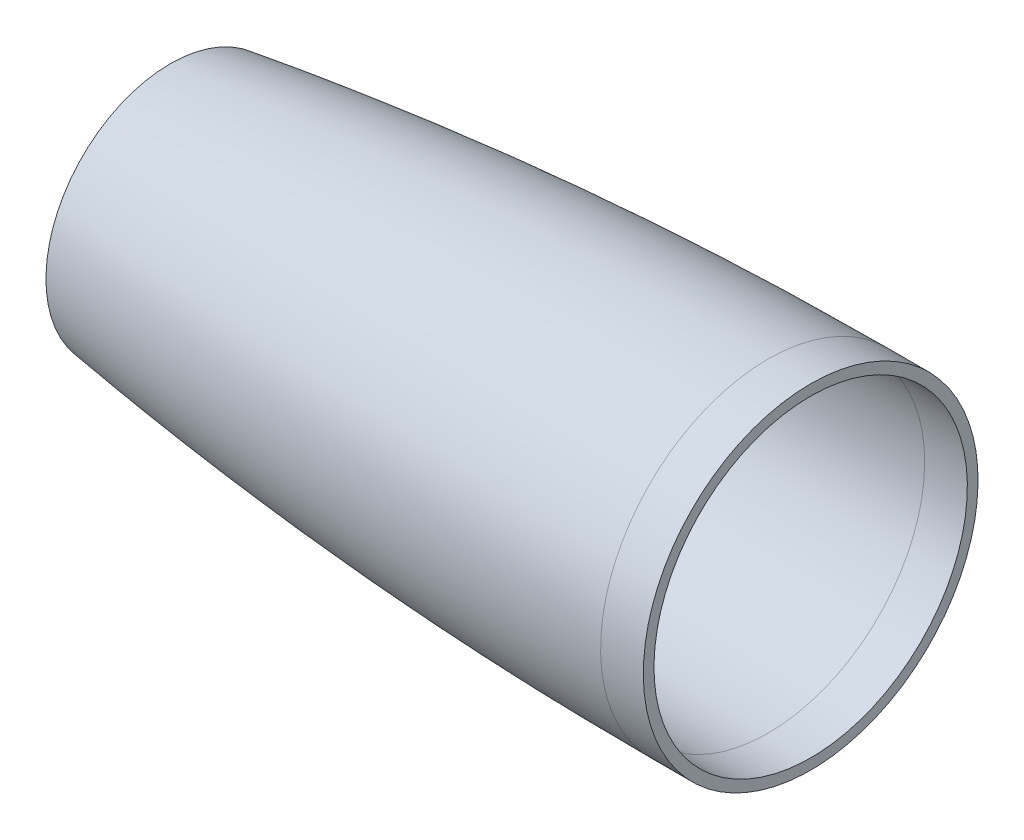
ISO-10303-21;
HEADER;
FILE_DESCRIPTION(('STEP AP214'),'2;1');
FILE_NAME('part.step','',(''),(''),'','','');
FILE_SCHEMA(('AUTOMOTIVE_DESIGN { 1 0 10303 214 1 1 1 1 }'));
ENDSEC;
DATA;
#1=APPLICATION_CONTEXT('core data for automotive mechanical design processes');
#2=APPLICATION_PROTOCOL_DEFINITION('international standard','automotive_design',2000,#1);
#3=PRODUCT_CONTEXT('',#1,'mechanical');
#4=PRODUCT('Part','Part','',(#3));
#5=PRODUCT_RELATED_PRODUCT_CATEGORY('part','',(#4));
#6=PRODUCT_DEFINITION_FORMATION('','',#4);
#7=PRODUCT_DEFINITION_CONTEXT('part definition',#1,'design');
#8=PRODUCT_DEFINITION('design','',#6,#7);
#9=PRODUCT_DEFINITION_SHAPE('','',#8);
#10=(LENGTH_UNIT() NAMED_UNIT(*) SI_UNIT(.MILLI.,.METRE.));
#11=(NAMED_UNIT(*) PLANE_ANGLE_UNIT() SI_UNIT($,.RADIAN.));
#12=(NAMED_UNIT(*) SI_UNIT($,.STERADIAN.) SOLID_ANGLE_UNIT());
#13=UNCERTAINTY_MEASURE_WITH_UNIT(LENGTH_MEASURE(1.E-05),#10,'distance_accuracy_value','');
#14=(GEOMETRIC_REPRESENTATION_CONTEXT(3) GLOBAL_UNCERTAINTY_ASSIGNED_CONTEXT((#13)) GLOBAL_UNIT_ASSIGNED_CONTEXT((#10,
#11,#12)) REPRESENTATION_CONTEXT('',''));
#15=CARTESIAN_POINT('',(0.,0.,0.));
#16=DIRECTION('',(0.,0.,1.));
#17=DIRECTION('',(1.,0.,0.));
#18=AXIS2_PLACEMENT_3D('',#15,#16,#17);
#19=CARTESIAN_POINT('',(507.999999999505,0.,0.));
#20=DIRECTION('',(-1.,0.,0.));
#21=DIRECTION('',(0.,-1.,0.));
#22=AXIS2_PLACEMENT_3D('',#19,#20,#21);
#23=CYLINDRICAL_SURFACE('',#22,49.784);
#24=CARTESIAN_POINT('',(304.799999999505,0.,0.));
#25=DIRECTION('',(1.,0.,0.));
#26=DIRECTION('',(0.,1.,0.));
#27=AXIS2_PLACEMENT_3D('',#24,#25,#26);
#28=CIRCLE('',#27,49.784);
#29=CARTESIAN_POINT('',(304.799999999505,49.784,0.));
#30=VERTEX_POINT('',#29);
#31=EDGE_CURVE('E10',#30,#30,#28,.T.);
#32=ORIENTED_EDGE('',*,*,#31,.T.);
#33=EDGE_LOOP('',(#32));
#34=FACE_BOUND('',#33,.T.);
#35=CARTESIAN_POINT('',(317.499999999505,0.,0.));
#36=DIRECTION('',(1.,0.,0.));
#37=DIRECTION('',(0.,1.,0.));
#38=AXIS2_PLACEMENT_3D('',#35,#36,#37);
#39=CIRCLE('',#38,49.784);
#40=CARTESIAN_POINT('',(317.499999999505,49.784,0.));
#41=VERTEX_POINT('',#40);
#42=EDGE_CURVE('E48',#41,#41,#39,.T.);
#43=ORIENTED_EDGE('',*,*,#42,.F.);
#44=EDGE_LOOP('',(#43));
#45=FACE_BOUND('',#44,.T.);
#46=ADVANCED_FACE('F40',(#34,#45),#23,.T.);
#47=CARTESIAN_POINT('',(304.799999990287,49.7839999999356,0.));
#48=CARTESIAN_POINT('',(304.362420109321,49.7839999999268,0.));
#49=CARTESIAN_POINT('',(303.482211221152,49.7834088052548,0.));
#50=CARTESIAN_POINT('',(301.617177870666,49.7807484292649,0.));
#51=CARTESIAN_POINT('',(299.535126271052,49.7736541034944,0.));
#52=CARTESIAN_POINT('',(297.470177020612,49.7630126402219,0.));
#53=CARTESIAN_POINT('',(295.35918685804,49.7488240698795,0.));
#54=CARTESIAN_POINT('',(293.263778354198,49.7310884330478,0.));
#55=CARTESIAN_POINT('',(291.166731436806,49.7098057804495,0.));
#56=CARTESIAN_POINT('',(288.521672795546,49.6784952503172,0.));
#57=CARTESIAN_POINT('',(285.329649652529,49.6334265452577,0.));
#58=CARTESIAN_POINT('',(281.590188304048,49.5699030834589,0.));
#59=CARTESIAN_POINT('',(277.303691578309,49.48226239004,0.));
#60=CARTESIAN_POINT('',(273.017475856952,49.3798045532393,0.));
#61=CARTESIAN_POINT('',(268.731666264679,49.262530797284,0.));
#62=CARTESIAN_POINT('',(264.446272338637,49.1304425234462,0.));
#63=CARTESIAN_POINT('',(260.161369668181,48.9835413100188,0.));
#64=CARTESIAN_POINT('',(253.734807706703,48.7409727135402,0.));
#65=CARTESIAN_POINT('',(245.168015053762,48.3681837485972,0.));
#66=CARTESIAN_POINT('',(207.702302927604,46.4349626079382,0.));
#67=CARTESIAN_POINT('',(160.707329089507,42.1599209125125,0.));
#68=CARTESIAN_POINT('',(110.770450736802,35.2251211949369,0.));
#69=CARTESIAN_POINT('',(62.3339038753587,25.9763701994142,0.));
#70=CARTESIAN_POINT('',(42.4128979252964,21.742539101878,0.));
#71=CARTESIAN_POINT('',(31.9521680351812,19.4056754890413,0.));
#72=CARTESIAN_POINT('',(26.7272384393463,18.2131472626268,0.));
#73=CARTESIAN_POINT('',(22.5506525227574,17.2446900479098,0.));
#74=CARTESIAN_POINT('',(18.9102609099226,16.3872914736853,0.));
#75=CARTESIAN_POINT('',(15.8050492233456,15.6465359898865,0.));
#76=CARTESIAN_POINT('',(13.2334128844101,15.0268619640981,0.));
#77=CARTESIAN_POINT('',(11.1954442275076,14.5321411193525,0.));
#78=CARTESIAN_POINT('',(9.15994822447513,14.0343879217128,0.));
#79=CARTESIAN_POINT('',(7.11012855188908,13.5293440242189,0.));
#80=CARTESIAN_POINT('',(5.10622259628834,13.032281092588,0.));
#81=CARTESIAN_POINT('',(3.08541050477275,12.5272726670259,0.));
#82=CARTESIAN_POINT('',(1.27776800563499,12.0717339202754,0.));
#83=CARTESIAN_POINT('',(0.424160674864923,11.8559326777936,0.));
#84=CARTESIAN_POINT('',(-8.94262127456441E-09,11.7483971703143,0.));
#85=B_SPLINE_CURVE_WITH_KNOTS('',4,(#47,#48,#49,#50,#51,#52,#53,#54,#55,#56,#57,#58,#59,#60,#61,
#62,#63,#64,#65,#66,#67,#68,#69,#70,#71,#72,#73,#74,#75,#76,#77,#78,#79,#80,#81,#82,#83,#84),
.UNSPECIFIED.,.F.,.F.,(5,1,1,1,1,1,1,1,1,1,1,1,1,1,1,1,1,1,1,1,1,1,1,1,1,1,1,1,1,1,1,1,1,1,5),
(0.0829178151015879,0.0886015106363571,0.0942852061412064,0.0999689016460558,0.105652597150905,
0.111336292655755,0.117019988160604,0.122703683665453,0.128387379170303,0.140005214528904,
0.151623049887505,0.163240885246106,0.174858720604706,0.18647655605003,0.198094391495354,
0.209712226940678,0.221330062386002,0.256183568844847,0.291037074687809,0.616336464163029,
0.732514817876367,0.802221831447538,0.825457500655397,0.837075336998531,0.848693173341665,
0.8603110096848,0.871928846027934,0.877612541812259,0.883296237596584,0.888979933380909,
0.894663629165234,0.900347324949559,0.906031020733883,0.911714716518208,0.917398412270913),.UNSPECIFIED.);
#86=CARTESIAN_POINT('',(304.799999999505,0.,0.));
#87=DIRECTION('',(1.,0.,0.));
#88=AXIS1_PLACEMENT('',#86,#87);
#89=SURFACE_OF_REVOLUTION('',#85,#88);
#90=CARTESIAN_POINT('',(126.999999999505,0.,0.));
#91=DIRECTION('',(1.,0.,0.));
#92=DIRECTION('',(0.,1.,0.));
#93=AXIS2_PLACEMENT_3D('',#90,#91,#92);
#94=CIRCLE('',#93,36.9736278029773);
#95=CARTESIAN_POINT('',(126.999999999505,36.9736278029773,0.));
#96=VERTEX_POINT('',#95);
#97=EDGE_CURVE('E43',#96,#96,#94,.F.);
#98=ORIENTED_EDGE('',*,*,#97,.F.);
#99=EDGE_LOOP('',(#98));
#100=FACE_BOUND('',#99,.T.);
#101=ORIENTED_EDGE('',*,*,#31,.F.);
#102=EDGE_LOOP('',(#101));
#103=FACE_BOUND('',#102,.T.);
#104=ADVANCED_FACE('F85',(#100,#103),#89,.F.);
#105=CARTESIAN_POINT('',(317.499999999505,0.,0.));
#106=DIRECTION('',(1.,0.,0.));
#107=DIRECTION('',(0.,1.,0.));
#108=AXIS2_PLACEMENT_3D('',#105,#106,#107);
#109=PLANE('',#108);
#110=CARTESIAN_POINT('',(317.499999999505,0.,0.));
#111=DIRECTION('',(1.,0.,0.));
#112=DIRECTION('',(0.,1.,0.));
#113=AXIS2_PLACEMENT_3D('',#110,#111,#112);
#114=CIRCLE('',#113,46.609);
#115=CARTESIAN_POINT('',(317.499999999505,46.609,0.));
#116=VERTEX_POINT('',#115);
#117=EDGE_CURVE('E59',#116,#116,#114,.T.);
#118=ORIENTED_EDGE('',*,*,#117,.F.);
#119=EDGE_LOOP('',(#118));
#120=FACE_BOUND('',#119,.T.);
#121=ORIENTED_EDGE('',*,*,#42,.T.);
#122=EDGE_LOOP('',(#121));
#123=FACE_BOUND('',#122,.T.);
#124=ADVANCED_FACE('F89',(#120,#123),#109,.T.);
#125=CARTESIAN_POINT('',(126.999999999505,0.,0.));
#126=DIRECTION('',(1.,0.,0.));
#127=DIRECTION('',(0.,1.,0.));
#128=AXIS2_PLACEMENT_3D('',#125,#126,#127);
#129=PLANE('',#128);
#130=CARTESIAN_POINT('',(126.999999999505,0.,0.));
#131=DIRECTION('',(1.,0.,0.));
#132=DIRECTION('',(0.,1.,0.));
#133=AXIS2_PLACEMENT_3D('',#130,#131,#132);
#134=CIRCLE('',#133,33.7654058835944);
#135=CARTESIAN_POINT('',(126.999999999505,33.7654058835944,0.));
#136=VERTEX_POINT('',#135);
#137=EDGE_CURVE('E55',#136,#136,#134,.F.);
#138=ORIENTED_EDGE('',*,*,#137,.F.);
#139=EDGE_LOOP('',(#138));
#140=FACE_BOUND('',#139,.T.);
#141=ORIENTED_EDGE('',*,*,#97,.T.);
#142=EDGE_LOOP('',(#141));
#143=FACE_BOUND('',#142,.T.);
#144=ADVANCED_FACE('F84',(#140,#143),#129,.F.);
#145=CARTESIAN_POINT('',(507.999999999505,0.,0.));
#146=DIRECTION('',(-1.,0.,0.));
#147=DIRECTION('',(0.,-1.,0.));
#148=AXIS2_PLACEMENT_3D('',#145,#146,#147);
#149=CYLINDRICAL_SURFACE('',#148,46.609);
#150=CARTESIAN_POINT('',(304.79999999043,46.6089999999356,0.));
#151=CARTESIAN_POINT('',(304.79999999043,46.6090161773964,0.7626387492578));
#152=CARTESIAN_POINT('',(304.79999999043,46.5902826237221,1.52527612197225));
#153=CARTESIAN_POINT('',(304.79999999043,46.5154322126844,3.04871434344847));
#154=CARTESIAN_POINT('',(304.799999990431,46.4593153553215,3.80951519221025));
#155=CARTESIAN_POINT('',(304.799999990431,46.3098144954873,5.32744659493664));
#156=CARTESIAN_POINT('',(304.799999990431,46.2164304930157,6.08457714890121));
#157=CARTESIAN_POINT('',(304.799999990432,45.9926254127623,7.59334421880328));
#158=CARTESIAN_POINT('',(304.799999990433,45.8622043349771,8.34498073474025));
#159=CARTESIAN_POINT('',(304.799999990433,45.5646379335094,9.84094890301253));
#160=CARTESIAN_POINT('',(304.799999990432,45.3974926098353,10.5852805553495));
#161=CARTESIAN_POINT('',(304.799999990437,45.0268807503819,12.0648458546299));
#162=CARTESIAN_POINT('',(304.799999990443,44.8234142145932,12.8000795015709));
#163=CARTESIAN_POINT('',(304.799999990431,44.3806500015755,14.2596775426758));
#164=CARTESIAN_POINT('',(304.799999990413,44.1413523243521,14.9840419368413));
#165=CARTESIAN_POINT('',(304.7999999904,43.6275023437991,16.4201564165152));
#166=CARTESIAN_POINT('',(304.799999990405,43.3529500404702,17.1319065020238));
#167=CARTESIAN_POINT('',(304.799999990408,42.7692522211541,18.5410776958797));
#168=CARTESIAN_POINT('',(304.799999990405,42.4601067051608,19.2384988042246));
#169=CARTESIAN_POINT('',(304.799999990409,41.807967221111,20.6173318950896));
#170=CARTESIAN_POINT('',(304.799999990416,41.4649732530591,21.2987438776118));
#171=CARTESIAN_POINT('',(304.799999990415,40.7459631668511,22.6439171357757));
#172=CARTESIAN_POINT('',(304.799999990409,40.3699470486939,23.3076784114167));
#173=CARTESIAN_POINT('',(304.799999990423,39.5857985181771,24.615951196761));
#174=CARTESIAN_POINT('',(304.799999990444,39.1776661058169,25.2604627064639));
#175=CARTESIAN_POINT('',(304.799999990447,38.3302682136143,26.5286832752064));
#176=CARTESIAN_POINT('',(304.79999999043,37.8910027337734,27.152392334247));
#177=CARTESIAN_POINT('',(304.799999990423,36.9823969356134,28.3775054319499));
#178=CARTESIAN_POINT('',(304.799999990434,36.5130566172941,28.9789094706119));
#179=CARTESIAN_POINT('',(304.799999990442,35.5454318241347,30.1579636925211));
#180=CARTESIAN_POINT('',(304.799999990438,35.0471473492957,30.7356138757691));
#181=CARTESIAN_POINT('',(304.799999990439,34.0228346539535,31.8657687770673));
#182=CARTESIAN_POINT('',(304.799999990444,33.4968064334463,32.4182734951139));
#183=CARTESIAN_POINT('',(304.799999990434,32.4182734950014,33.4968064335516));
#184=CARTESIAN_POINT('',(304.799999990418,31.8657687770692,34.0228346539481));
#185=CARTESIAN_POINT('',(304.799999990406,30.7356138758519,35.0471473492242));
#186=CARTESIAN_POINT('',(304.79999999041,30.1579636925633,35.5454318240998));
#187=CARTESIAN_POINT('',(304.799999990421,28.978909470612,36.5130566172943));
#188=CARTESIAN_POINT('',(304.799999990427,28.3775054319499,36.982396935614));
#189=CARTESIAN_POINT('',(304.799999990426,27.1523923341977,37.8910027338093));
#190=CARTESIAN_POINT('',(304.79999999042,26.5286832751059,38.3302682136827));
#191=CARTESIAN_POINT('',(304.799999990412,25.2604627063761,39.1776661058742));
#192=CARTESIAN_POINT('',(304.799999990411,24.6159511967409,39.5857985181966));
#193=CARTESIAN_POINT('',(304.799999990421,23.3076784114084,40.3699470486914));
#194=CARTESIAN_POINT('',(304.799999990434,22.6439171357079,40.7459631668583));
#195=CARTESIAN_POINT('',(304.799999990443,21.2987438775281,41.4649732531328));
#196=CARTESIAN_POINT('',(304.79999999044,20.6173318950521,41.8079672212466));
#197=CARTESIAN_POINT('',(304.799999990438,19.2384988043294,42.4601067049933));
#198=CARTESIAN_POINT('',(304.799999990439,18.5410776960821,42.7692522206252));
#199=CARTESIAN_POINT('',(304.79999999044,17.1319065022844,43.3529500408074));
#200=CARTESIAN_POINT('',(304.79999999044,16.4201564167322,43.6275023453532));
#201=CARTESIAN_POINT('',(304.799999990439,14.9840419367196,44.1413523227638));
#202=CARTESIAN_POINT('',(304.799999990438,14.2596775422594,44.380649995629));
#203=CARTESIAN_POINT('',(304.799999990436,12.8000795017931,44.8234142205986));
#204=CARTESIAN_POINT('',(304.799999990435,12.0648458557885,45.0268807727079));
#205=CARTESIAN_POINT('',(304.799999990434,10.5852805543126,45.3974925874789));
#206=CARTESIAN_POINT('',(304.799999990435,9.84094889884035,45.5646378501368));
#207=CARTESIAN_POINT('',(304.799999990434,8.34498073876595,45.8622044183788));
#208=CARTESIAN_POINT('',(304.799999990433,7.59334423416482,45.9926257239682));
#209=CARTESIAN_POINT('',(304.799999990431,6.08457713382946,46.2164301817669));
#210=CARTESIAN_POINT('',(304.799999990431,5.3274465380947,46.3098133339727));
#211=CARTESIAN_POINT('',(304.799999990431,3.80951524941658,46.4593165168002));
#212=CARTESIAN_POINT('',(304.799999990431,3.04871455647289,46.5154365474184));
#213=CARTESIAN_POINT('',(304.79999999043,1.52527590901936,46.5902782889846));
#214=CARTESIAN_POINT('',(304.79999999043,0.762637954509687,46.6089999999357));
#215=CARTESIAN_POINT('',(304.79999999043,-0.762637954509895,46.6089999999357));
#216=CARTESIAN_POINT('',(304.79999999043,-1.52527590901981,46.5902782889845));
#217=CARTESIAN_POINT('',(304.79999999043,-3.04871455640001,46.515436547422));
#218=CARTESIAN_POINT('',(304.799999990431,-3.80951524927033,46.459316516811));
#219=CARTESIAN_POINT('',(304.799999990432,-5.3274465379595,46.3098133339897));
#220=CARTESIAN_POINT('',(304.799999990433,-6.08457713377793,46.2164301817751));
#221=CARTESIAN_POINT('',(304.799999990431,-7.5933442341545,45.9926257239692));
#222=CARTESIAN_POINT('',(304.79999999043,-8.34498073871407,45.8622044183876));
#223=CARTESIAN_POINT('',(304.799999990436,-9.84094889870365,45.5646378501656));
#224=CARTESIAN_POINT('',(304.799999990444,-10.5852805541326,45.3974925875201));
#225=CARTESIAN_POINT('',(304.799999990426,-12.0648458557342,45.0268807727253));
#226=CARTESIAN_POINT('',(304.7999999904,-12.8000795019051,44.8234142205696));
#227=CARTESIAN_POINT('',(304.799999990406,-14.2596775424223,44.3806499955747));
#228=CARTESIAN_POINT('',(304.799999990437,-14.9840419367713,44.1413523227443));
#229=CARTESIAN_POINT('',(304.799999990443,-16.420156416696,43.6275023453673));
#230=CARTESIAN_POINT('',(304.799999990417,-17.1319065022694,43.3529500408137));
#231=CARTESIAN_POINT('',(304.799999990397,-18.5410776960587,42.7692522206348));
#232=CARTESIAN_POINT('',(304.799999990402,-19.2384988042776,42.4601067050162));
#233=CARTESIAN_POINT('',(304.799999990412,-20.6173318950342,41.8079672212567));
#234=CARTESIAN_POINT('',(304.799999990416,-21.2987438775704,41.4649732531124));
#235=CARTESIAN_POINT('',(304.799999990415,-22.643917135797,40.7459631668086));
#236=CARTESIAN_POINT('',(304.799999990411,-23.3076784114859,40.3699470486464));
#237=CARTESIAN_POINT('',(304.799999990421,-24.615951196801,39.5857985181591));
#238=CARTESIAN_POINT('',(304.799999990435,-25.2604627064302,39.1776661058392));
#239=CARTESIAN_POINT('',(304.799999990457,-26.5286832751171,38.3302682136741));
#240=CARTESIAN_POINT('',(304.799999990465,-27.1523923341729,37.8910027338262));
#241=CARTESIAN_POINT('',(304.799999990446,-28.3775054318182,36.9823969357133));
#242=CARTESIAN_POINT('',(304.799999990419,-28.9789094704105,36.5130566174522));
#243=CARTESIAN_POINT('',(304.799999990411,-30.1579636923432,35.5454318242878));
#244=CARTESIAN_POINT('',(304.79999999043,-30.7356138756782,35.0471473493778));
#245=CARTESIAN_POINT('',(304.799999990447,-31.8657687769849,34.0228346540283));
#246=CARTESIAN_POINT('',(304.799999990446,-32.4182734949603,33.4968064335927));
#247=CARTESIAN_POINT('',(304.799999990431,-33.4968064334101,32.4182734951501));
#248=CARTESIAN_POINT('',(304.799999990418,-34.0228346538829,31.8657687771414));
#249=CARTESIAN_POINT('',(304.799999990407,-35.0471473492367,30.7356138758379));
#250=CARTESIAN_POINT('',(304.79999999041,-35.5454318241175,30.1579636925428));
#251=CARTESIAN_POINT('',(304.799999990421,-36.5130566173245,28.9789094705743));
#252=CARTESIAN_POINT('',(304.799999990429,-36.9823969356514,28.3775054319016));
#253=CARTESIAN_POINT('',(304.799999990424,-37.891002733814,27.1523923341894));
#254=CARTESIAN_POINT('',(304.799999990412,-38.3302682136505,26.5286832751506));
#255=CARTESIAN_POINT('',(304.79999999042,-39.1776661058278,25.2604627064491));
#256=CARTESIAN_POINT('',(304.799999990439,-39.5857985181688,24.6159511967865));
#257=CARTESIAN_POINT('',(304.799999990454,-40.3699470486562,23.3076784114679));
#258=CARTESIAN_POINT('',(304.79999999045,-40.7459631668004,22.6439171358105));
#259=CARTESIAN_POINT('',(304.799999990444,-41.4649732530967,21.2987438776015));
#260=CARTESIAN_POINT('',(304.79999999044,-41.8079672212492,20.61733189505));
#261=CARTESIAN_POINT('',(304.799999990438,-42.4601067050685,19.2384988041672));
#262=CARTESIAN_POINT('',(304.799999990439,-42.7692522207338,18.5410776958353));
#263=CARTESIAN_POINT('',(304.799999990441,-43.3529500409017,17.1319065020413));
#264=CARTESIAN_POINT('',(304.799999990441,-43.6275023454084,16.4201564165811));
#265=CARTESIAN_POINT('',(304.799999990439,-44.1413523227699,14.9840419366998));
#266=CARTESIAN_POINT('',(304.799999990435,-44.3806499956223,14.2596775422781));
#267=CARTESIAN_POINT('',(304.799999990433,-44.8234142205699,12.8000795018913));
#268=CARTESIAN_POINT('',(304.799999990435,-45.0268807726698,12.0648458559278));
#269=CARTESIAN_POINT('',(304.799999990435,-45.3974925874417,10.5852805544734));
#270=CARTESIAN_POINT('',(304.799999990433,-45.5646378501068,9.84094889898083));
#271=CARTESIAN_POINT('',(304.799999990432,-45.8622044183628,8.34498073885668));
#272=CARTESIAN_POINT('',(304.799999990432,-45.9926257239586,7.59334423422607));
#273=CARTESIAN_POINT('',(304.799999990431,-46.2164301817778,6.08457713375939));
#274=CARTESIAN_POINT('',(304.799999990431,-46.3098133339942,5.32744653792225));
#275=CARTESIAN_POINT('',(304.799999990431,-46.4593165168182,3.8095152491872));
#276=CARTESIAN_POINT('',(304.799999990431,-46.5154365474297,3.04871455628967));
#277=CARTESIAN_POINT('',(304.79999999043,-46.5902782889868,1.525275908928));
#278=CARTESIAN_POINT('',(304.79999999043,-46.6089999999357,0.762637954464015));
#279=CARTESIAN_POINT('',(304.79999999043,-46.6089999999357,-0.76263795453763));
#280=CARTESIAN_POINT('',(304.79999999043,-46.5902782889832,-1.52527590907529));
#281=CARTESIAN_POINT('',(304.799999990431,-46.5154365474152,-3.04871455651084));
#282=CARTESIAN_POINT('',(304.799999990432,-46.4593165168001,-3.80951524940874));
#283=CARTESIAN_POINT('',(304.79999999043,-46.3098133339761,-5.32744653806976));
#284=CARTESIAN_POINT('',(304.799999990426,-46.2164301817669,-6.08457713383285));
#285=CARTESIAN_POINT('',(304.799999990438,-45.9926257239692,-7.59334423415449));
#286=CARTESIAN_POINT('',(304.799999990453,-45.8622044183876,-8.34498073871406));
#287=CARTESIAN_POINT('',(304.799999990412,-45.5646378501656,-9.84094889870364));
#288=CARTESIAN_POINT('',(304.799999990357,-45.3974925875201,-10.5852805541326));
#289=CARTESIAN_POINT('',(304.799999990291,-45.0268807727253,-12.0648458557341));
#290=CARTESIAN_POINT('',(304.799999990282,-44.8234142205696,-12.800079501905));
#291=CARTESIAN_POINT('',(304.799999990298,-44.3806499955581,-14.2596775424769));
#292=CARTESIAN_POINT('',(304.799999990324,-44.1413523227085,-14.9840419368796));
#293=CARTESIAN_POINT('',(304.79999999033,-43.6275023453215,-16.4201564168158));
#294=CARTESIAN_POINT('',(304.79999999031,-43.3529500407817,-17.1319065023484));
#295=CARTESIAN_POINT('',(304.799999990345,-42.7692522206233,-18.5410776960845));
#296=CARTESIAN_POINT('',(304.7999999904,-42.4601067050102,-19.2384988042904));
#297=CARTESIAN_POINT('',(304.79999999043,-41.8079672212492,-20.61733189505));
#298=CARTESIAN_POINT('',(304.799999990405,-41.4649732530968,-21.2987438776015));
#299=CARTESIAN_POINT('',(304.799999990409,-40.7459631667915,-22.6439171358272));
#300=CARTESIAN_POINT('',(304.799999990437,-40.3699470486375,-23.3076784115008));
#301=CARTESIAN_POINT('',(304.799999990456,-39.5857985181801,-24.6159511967659));
#302=CARTESIAN_POINT('',(304.799999990446,-39.1776661058829,-25.2604627063612));
#303=CARTESIAN_POINT('',(304.799999990446,-38.3302682137212,-26.5286832750503));
#304=CARTESIAN_POINT('',(304.799999990456,-37.8910027338505,-27.1523923341401));
#305=CARTESIAN_POINT('',(304.799999990454,-36.9823969356514,-28.3775054319015));
#306=CARTESIAN_POINT('',(304.799999990443,-36.5130566173245,-28.9789094705743));
#307=CARTESIAN_POINT('',(304.799999990434,-35.5454318241175,-30.1579636925427));
#308=CARTESIAN_POINT('',(304.799999990437,-35.0471473492367,-30.7356138758379));
#309=CARTESIAN_POINT('',(304.79999999044,-34.0228346538829,-31.8657687771414));
#310=CARTESIAN_POINT('',(304.799999990441,-33.4968064334101,-32.4182734951501));
#311=CARTESIAN_POINT('',(304.799999990437,-32.4182734949989,-33.496806433554));
#312=CARTESIAN_POINT('',(304.799999990433,-31.8657687770642,-34.0228346539529));
#313=CARTESIAN_POINT('',(304.799999990391,-30.7356138758032,-35.0471473492681));
#314=CARTESIAN_POINT('',(304.799999990352,-30.1579636924719,-35.5454318241786));
#315=CARTESIAN_POINT('',(304.799999990323,-28.9789094704835,-36.513056617396));
#316=CARTESIAN_POINT('',(304.799999990332,-28.3775054318293,-36.9823969357063));
#317=CARTESIAN_POINT('',(304.799999990321,-27.1523923341042,-37.8910027338758));
#318=CARTESIAN_POINT('',(304.799999990302,-26.5286832750321,-38.3302682137333));
#319=CARTESIAN_POINT('',(304.799999990352,-25.2604627063455,-39.1776661058934));
#320=CARTESIAN_POINT('',(304.799999990421,-24.6159511967339,-39.5857985182003));
#321=CARTESIAN_POINT('',(304.799999990472,-23.3076784114121,-40.3699470486896));
#322=CARTESIAN_POINT('',(304.799999990453,-22.6439171356973,-40.7459631668645));
#323=CARTESIAN_POINT('',(304.799999990441,-21.2987438774853,-41.4649732531553));
#324=CARTESIAN_POINT('',(304.799999990447,-20.6173318949912,-41.807967221277));
#325=CARTESIAN_POINT('',(304.799999990447,-19.2384988041672,-42.4601067050685));
#326=CARTESIAN_POINT('',(304.799999990442,-18.5410776958353,-42.7692522207338));
#327=CARTESIAN_POINT('',(304.799999990438,-17.1319065021055,-43.3529500408751));
#328=CARTESIAN_POINT('',(304.79999999044,-16.4201564167107,-43.6275023453584));
#329=CARTESIAN_POINT('',(304.79999999044,-14.9840419368318,-44.1413523227263));
#330=CARTESIAN_POINT('',(304.799999990438,-14.2596775423445,-44.3806499956021));
#331=CARTESIAN_POINT('',(304.799999990436,-12.8000795018956,-44.8234142205685));
#332=CARTESIAN_POINT('',(304.799999990435,-12.0648458559364,-45.0268807726674));
#333=CARTESIAN_POINT('',(304.799999990434,-10.5852805544787,-45.3974925874406));
#334=CARTESIAN_POINT('',(304.799999990435,-9.84094889897822,-45.5646378501075));
#335=CARTESIAN_POINT('',(304.799999990431,-8.34498073884827,-45.8622044183643));
#336=CARTESIAN_POINT('',(304.799999990426,-7.59334423421986,-45.9926257239595));
#337=CARTESIAN_POINT('',(304.799999990438,-6.08457713375761,-46.216430181778));
#338=CARTESIAN_POINT('',(304.799999990454,-5.32744653792271,-46.3098133339942));
#339=CARTESIAN_POINT('',(304.799999990408,-3.80951524918901,-46.4593165168181));
#340=CARTESIAN_POINT('',(304.799999990346,-3.04871455629058,-46.5154365474296));
#341=CARTESIAN_POINT('',(304.7999999903,-1.525275908928,-46.5902782889868));
#342=CARTESIAN_POINT('',(304.799999990317,-0.762637954464024,-46.6089999999357));
#343=CARTESIAN_POINT('',(304.799999990329,0.762637954537621,-46.6089999999357));
#344=CARTESIAN_POINT('',(304.799999990323,1.52527590907528,-46.5902782889832));
#345=CARTESIAN_POINT('',(304.799999990323,3.04871455650993,-46.5154365474152));
#346=CARTESIAN_POINT('',(304.799999990329,3.80951524940693,-46.4593165168002));
#347=CARTESIAN_POINT('',(304.799999990318,5.32744653806526,-46.3098133339765));
#348=CARTESIAN_POINT('',(304.799999990302,6.08457713382658,-46.2164301817677));
#349=CARTESIAN_POINT('',(304.799999990346,7.59334423414558,-45.9926257239706));
#350=CARTESIAN_POINT('',(304.799999990407,8.3449807387043,-45.8622044183893));
#351=CARTESIAN_POINT('',(304.799999990459,9.84094889876678,-45.5646378501532));
#352=CARTESIAN_POINT('',(304.79999999045,10.5852805542688,-45.3974925874896));
#353=CARTESIAN_POINT('',(304.799999990419,12.0648458558721,-45.0268807726872));
#354=CARTESIAN_POINT('',(304.799999990397,12.8000795019735,-44.8234142205488));
#355=CARTESIAN_POINT('',(304.799999990408,14.2596775424768,-44.3806499955581));
#356=CARTESIAN_POINT('',(304.799999990442,14.9840419368796,-44.1413523227085));
#357=CARTESIAN_POINT('',(304.799999990438,16.4201564167516,-43.6275023453444));
#358=CARTESIAN_POINT('',(304.799999990401,17.1319065022212,-43.3529500408308));
#359=CARTESIAN_POINT('',(304.799999990413,18.5410776959599,-42.7692522206786));
#360=CARTESIAN_POINT('',(304.799999990461,19.2384988042288,-42.4601067050393));
#361=CARTESIAN_POINT('',(304.799999990433,20.61733189505,-41.8079672212492));
#362=CARTESIAN_POINT('',(304.799999990355,21.2987438776015,-41.4649732530967));
#363=CARTESIAN_POINT('',(304.799999990299,22.6439171358105,-40.7459631668004));
#364=CARTESIAN_POINT('',(304.79999999032,23.3076784114678,-40.3699470486562));
#365=CARTESIAN_POINT('',(304.799999990334,24.6159511967865,-39.5857985181688));
#366=CARTESIAN_POINT('',(304.799999990328,25.2604627064491,-39.1776661058278));
#367=CARTESIAN_POINT('',(304.799999990325,26.5286832751871,-38.3302682136261));
#368=CARTESIAN_POINT('',(304.799999990328,27.1523923342612,-37.8910027337634));
#369=CARTESIAN_POINT('',(304.799999990325,28.3775054319332,-36.9823969356252));
#370=CARTESIAN_POINT('',(304.79999999032,28.9789094705344,-36.5130566173542));
#371=CARTESIAN_POINT('',(304.7999999903,30.1579636924718,-35.5454318241786));
#372=CARTESIAN_POINT('',(304.799999990286,30.7356138758032,-35.0471473492681));
#373=CARTESIAN_POINT('',(304.799999990341,31.8657687770641,-34.022834653953));
#374=CARTESIAN_POINT('',(304.799999990411,32.4182734949989,-33.4968064335541));
#375=CARTESIAN_POINT('',(304.799999990467,33.4968064334137,-32.4182734951465));
#376=CARTESIAN_POINT('',(304.799999990454,34.0228346538899,-31.865768777134));
#377=CARTESIAN_POINT('',(304.799999990424,35.0471473492434,-30.7356138758301));
#378=CARTESIAN_POINT('',(304.799999990408,35.5454318241208,-30.1579636925388));
#379=CARTESIAN_POINT('',(304.799999990423,36.5130566173006,-28.9789094706031));
#380=CARTESIAN_POINT('',(304.799999990456,36.9823969356049,-28.3775054319603));
#381=CARTESIAN_POINT('',(304.799999990455,37.8910027337716,-27.1523923342504));
#382=CARTESIAN_POINT('',(304.799999990422,38.330268213632,-26.5286832751817));
#383=CARTESIAN_POINT('',(304.79999999041,39.1776661058255,-25.260462706449));
#384=CARTESIAN_POINT('',(304.79999999043,39.5857985181605,-24.6159511967861));
#385=CARTESIAN_POINT('',(304.799999990463,40.3699470486979,-23.3076784114125));
#386=CARTESIAN_POINT('',(304.799999990475,40.7459631668954,-22.6439171356988));
#387=CARTESIAN_POINT('',(304.799999990419,41.4649732531244,-21.2987438774837));
#388=CARTESIAN_POINT('',(304.799999990349,41.8079672211618,-20.6173318949855));
#389=CARTESIAN_POINT('',(304.799999990305,42.4601067051545,-19.2384988042345));
#390=CARTESIAN_POINT('',(304.799999990329,42.7692522211084,-18.541077695981));
#391=CARTESIAN_POINT('',(304.799999990325,43.3529500403962,-17.1319065022116));
#392=CARTESIAN_POINT('',(304.799999990296,43.6275023437312,-16.420156416696));
#393=CARTESIAN_POINT('',(304.79999999029,44.1413523243305,-14.9840419369106));
#394=CARTESIAN_POINT('',(304.799999990313,44.3806500015894,-14.2596775426386));
#395=CARTESIAN_POINT('',(304.799999990334,44.8234142145813,-12.8000795016015));
#396=CARTESIAN_POINT('',(304.799999990332,45.0268807503228,-12.0648458548387));
#397=CARTESIAN_POINT('',(304.799999990316,45.3974926097844,-10.5852805555799));
#398=CARTESIAN_POINT('',(304.799999990301,45.5646379334971,-9.84094890308198));
#399=CARTESIAN_POINT('',(304.799999990347,45.8622043349722,-8.34498073475728));
#400=CARTESIAN_POINT('',(304.799999990409,45.9926254127393,-7.59334421893148));
#401=CARTESIAN_POINT('',(304.799999990454,46.2164304929986,-6.08457714904329));
#402=CARTESIAN_POINT('',(304.799999990437,46.3098144954839,-5.32744659497988));
#403=CARTESIAN_POINT('',(304.799999990424,46.4593153553288,-3.80951519212689));
#404=CARTESIAN_POINT('',(304.799999990427,46.5154322126921,-3.04871434333768));
#405=CARTESIAN_POINT('',(304.799999990433,46.5902826237243,-1.52527612188));
#406=CARTESIAN_POINT('',(304.799999990437,46.6090161773964,-0.762638749211697));
#407=CARTESIAN_POINT('',(304.79999999043,46.6089999999356,0.));
#408=B_SPLINE_CURVE_WITH_KNOTS('',3,(#150,#151,#152,#153,#154,#155,#156,#157,#158,#159,#160,
#161,#162,#163,#164,#165,#166,#167,#168,#169,#170,#171,#172,#173,#174,#175,#176,#177,#178,#179,
#180,#181,#182,#183,#184,#185,#186,#187,#188,#189,#190,#191,#192,#193,#194,#195,#196,#197,#198,
#199,#200,#201,#202,#203,#204,#205,#206,#207,#208,#209,#210,#211,#212,#213,#214,#215,#216,#217,
#218,#219,#220,#221,#222,#223,#224,#225,#226,#227,#228,#229,#230,#231,#232,#233,#234,#235,#236,
#237,#238,#239,#240,#241,#242,#243,#244,#245,#246,#247,#248,#249,#250,#251,#252,#253,#254,#255,
#256,#257,#258,#259,#260,#261,#262,#263,#264,#265,#266,#267,#268,#269,#270,#271,#272,#273,#274,
#275,#276,#277,#278,#279,#280,#281,#282,#283,#284,#285,#286,#287,#288,#289,#290,#291,#292,#293,
#294,#295,#296,#297,#298,#299,#300,#301,#302,#303,#304,#305,#306,#307,#308,#309,#310,#311,#312,
#313,#314,#315,#316,#317,#318,#319,#320,#321,#322,#323,#324,#325,#326,#327,#328,#329,#330,#331,
#332,#333,#334,#335,#336,#337,#338,#339,#340,#341,#342,#343,#344,#345,#346,#347,#348,#349,#350,
#351,#352,#353,#354,#355,#356,#357,#358,#359,#360,#361,#362,#363,#364,#365,#366,#367,#368,#369,
#370,#371,#372,#373,#374,#375,#376,#377,#378,#379,#380,#381,#382,#383,#384,#385,#386,#387,#388,
#389,#390,#391,#392,#393,#394,#395,#396,#397,#398,#399,#400,#401,#402,#403,#404,#405,#406,#407),
.UNSPECIFIED.,.F.,.F.,(4,2,2,2,2,2,2,2,2,2,2,2,2,2,2,2,2,2,2,2,2,2,2,2,2,2,2,2,2,2,2,2,2,2,2,2,
2,2,2,2,2,2,2,2,2,2,2,2,2,2,2,2,2,2,2,2,2,2,2,2,2,2,2,2,2,2,2,2,2,2,2,2,2,2,2,2,2,2,2,2,2,2,2,2,
2,2,2,2,2,2,2,2,2,2,2,2,2,2,2,2,2,2,2,2,2,2,2,2,2,2,2,2,2,2,2,2,2,2,2,2,2,2,2,2,2,2,2,2,4),(0.,
2.2876842404368,4.57536848084821,6.86305272127304,9.15073696191056,11.4384212020209,
13.7261054427216,16.0137896830667,18.3014739233603,20.5891581640532,22.8768424044443,
25.1645266449181,27.4522108854386,29.739895125851,32.0275793662861,34.3152636066278,
36.6029478472873,38.89063208747,41.1783163279756,43.4660005684107,45.7536848090071,
48.0413690492868,50.3290532899603,52.6167375302085,54.904421770535,57.1921060111578,
59.4797902517518,61.7674744920397,64.0551587325681,66.3428429727699,68.6305272131934,
70.9182114538263,73.2058956942617,75.4935799346978,77.7812641751099,80.0689484157854,
82.3566326558606,84.6443168962544,86.9320011370596,89.2196853773045,91.5073696179945,
93.7950538582271,96.0827380986774,98.3704223393138,100.658106579574,102.945790820039,
105.233475060201,107.521159300879,109.808843541236,112.096527781742,114.384212022273,
116.671896262746,118.959580503149,121.247264743528,123.534948984056,125.822633224558,
128.110317465157,130.398001705481,132.685685945953,134.973370186115,137.261054426708,
139.548738667,141.836422907732,144.124107148225,146.411791388523,148.699475629043,
150.987159869538,153.274844110047,155.562528350122,157.850212590516,160.137896831321,
162.425581071737,164.713265312299,167.000949552489,169.288633792991,171.576318033576,
173.864002273714,176.1516865143,178.439370754774,180.727054995305,183.014739235811,
185.302423476004,187.590107716675,189.877791957074,192.165476197595,194.45316043779,
196.740844678512,199.02852891882,201.316213159419,203.603897399534,205.891581640215,
208.179265880363,210.46695012098,212.754634361266,215.042318601991,217.330002842487,
219.617687082785,221.905371323304,224.193055563797,226.480739804301,228.768424044373,
231.056108284992,233.343792525583,235.631476765999,237.919161006356,240.206845246751,
242.494529487253,244.78221372778,247.069897968159,249.357582208694,251.645266448896,
253.932950689566,256.22063492976,258.508319170281,260.796003410796,263.083687651158,
265.371371891673,267.659056132052,269.946740372774,272.234424613082,274.522108853476,
276.809793093796,279.097477334477,281.385161574625,283.672845815231,285.960530055531,
288.248214296255,290.535898536748,292.823582777047),.UNSPECIFIED.);
#409=CARTESIAN_POINT('',(304.79999999043,46.6089999999356,0.));
#410=VERTEX_POINT('',#409);
#411=EDGE_CURVE('E63',#410,#410,#408,.T.);
#412=ORIENTED_EDGE('',*,*,#411,.F.);
#413=EDGE_LOOP('',(#412));
#414=FACE_BOUND('',#413,.T.);
#415=ORIENTED_EDGE('',*,*,#117,.T.);
#416=EDGE_LOOP('',(#415));
#417=FACE_BOUND('',#416,.T.);
#418=ADVANCED_FACE('F81',(#414,#417),#149,.F.);
#419=CARTESIAN_POINT('',(304.799999990287,49.7839999999356,0.));
#420=CARTESIAN_POINT('',(304.362420109321,49.7839999999268,0.));
#421=CARTESIAN_POINT('',(303.482211221152,49.7834088052548,0.));
#422=CARTESIAN_POINT('',(301.617177870666,49.7807484292649,0.));
#423=CARTESIAN_POINT('',(299.535126271052,49.7736541034944,0.));
#424=CARTESIAN_POINT('',(297.470177020612,49.7630126402219,0.));
#425=CARTESIAN_POINT('',(295.35918685804,49.7488240698795,0.));
#426=CARTESIAN_POINT('',(293.263778354198,49.7310884330478,0.));
#427=CARTESIAN_POINT('',(291.166731436806,49.7098057804495,0.));
#428=CARTESIAN_POINT('',(288.521672795546,49.6784952503172,0.));
#429=CARTESIAN_POINT('',(285.329649652529,49.6334265452577,0.));
#430=CARTESIAN_POINT('',(281.590188304048,49.5699030834589,0.));
#431=CARTESIAN_POINT('',(277.303691578309,49.48226239004,0.));
#432=CARTESIAN_POINT('',(273.017475856952,49.3798045532393,0.));
#433=CARTESIAN_POINT('',(268.731666264679,49.262530797284,0.));
#434=CARTESIAN_POINT('',(264.446272338637,49.1304425234462,0.));
#435=CARTESIAN_POINT('',(260.161369668181,48.9835413100188,0.));
#436=CARTESIAN_POINT('',(253.734807706703,48.7409727135402,0.));
#437=CARTESIAN_POINT('',(245.168015053762,48.3681837485972,0.));
#438=CARTESIAN_POINT('',(207.702302927604,46.4349626079382,0.));
#439=CARTESIAN_POINT('',(160.707329089507,42.1599209125125,0.));
#440=CARTESIAN_POINT('',(110.770450736802,35.2251211949369,0.));
#441=CARTESIAN_POINT('',(62.3339038753587,25.9763701994142,0.));
#442=CARTESIAN_POINT('',(42.4128979252964,21.742539101878,0.));
#443=CARTESIAN_POINT('',(31.9521680351812,19.4056754890413,0.));
#444=CARTESIAN_POINT('',(26.7272384393463,18.2131472626268,0.));
#445=CARTESIAN_POINT('',(22.5506525227574,17.2446900479098,0.));
#446=CARTESIAN_POINT('',(18.9102609099226,16.3872914736853,0.));
#447=CARTESIAN_POINT('',(15.8050492233456,15.6465359898865,0.));
#448=CARTESIAN_POINT('',(13.2334128844101,15.0268619640981,0.));
#449=CARTESIAN_POINT('',(11.1954442275076,14.5321411193525,0.));
#450=CARTESIAN_POINT('',(9.15994822447513,14.0343879217128,0.));
#451=CARTESIAN_POINT('',(7.11012855188908,13.5293440242189,0.));
#452=CARTESIAN_POINT('',(5.10622259628834,13.032281092588,0.));
#453=CARTESIAN_POINT('',(3.08541050477275,12.5272726670259,0.));
#454=CARTESIAN_POINT('',(1.27776800563499,12.0717339202754,0.));
#455=CARTESIAN_POINT('',(0.424160674864923,11.8559326777936,0.));
#456=CARTESIAN_POINT('',(-8.94262127456441E-09,11.7483971703143,0.));
#457=B_SPLINE_CURVE_WITH_KNOTS('',4,(#419,#420,#421,#422,#423,#424,#425,#426,#427,#428,#429,
#430,#431,#432,#433,#434,#435,#436,#437,#438,#439,#440,#441,#442,#443,#444,#445,#446,#447,#448,
#449,#450,#451,#452,#453,#454,#455,#456),.UNSPECIFIED.,.F.,.F.,(5,1,1,1,1,1,1,1,1,1,1,1,1,1,1,1,
1,1,1,1,1,1,1,1,1,1,1,1,1,1,1,1,1,1,5),(0.0829178151015879,0.0886015106363571,
0.0942852061412064,0.0999689016460558,0.105652597150905,0.111336292655755,0.117019988160604,
0.122703683665453,0.128387379170303,0.140005214528904,0.151623049887505,0.163240885246106,
0.174858720604706,0.18647655605003,0.198094391495354,0.209712226940678,0.221330062386002,
0.256183568844847,0.291037074687809,0.616336464163029,0.732514817876367,0.802221831447538,
0.825457500655397,0.837075336998531,0.848693173341665,0.8603110096848,0.871928846027934,
0.877612541812259,0.883296237596584,0.888979933380909,0.894663629165234,0.900347324949559,
0.906031020733883,0.911714716518208,0.917398412270913),.UNSPECIFIED.);
#458=CARTESIAN_POINT('',(304.799999999505,0.,0.));
#459=DIRECTION('',(1.,0.,0.));
#460=AXIS1_PLACEMENT('',#458,#459);
#461=SURFACE_OF_REVOLUTION('',#457,#460);
#462=OFFSET_SURFACE('',#461,3.175,.F.);
#463=ORIENTED_EDGE('',*,*,#137,.T.);
#464=EDGE_LOOP('',(#463));
#465=FACE_BOUND('',#464,.T.);
#466=ORIENTED_EDGE('',*,*,#411,.T.);
#467=EDGE_LOOP('',(#466));
#468=FACE_BOUND('',#467,.T.);
#469=ADVANCED_FACE('F70',(#465,#468),#462,.T.);
#470=CLOSED_SHELL('',(#46,#104,#124,#144,#418,#469));
#471=MANIFOLD_SOLID_BREP('B2',#470);
#472=ADVANCED_BREP_SHAPE_REPRESENTATION('',(#18,#471),#14);
#473=SHAPE_DEFINITION_REPRESENTATION(#9,#472);
ENDSEC;
END-ISO-10303-21;
